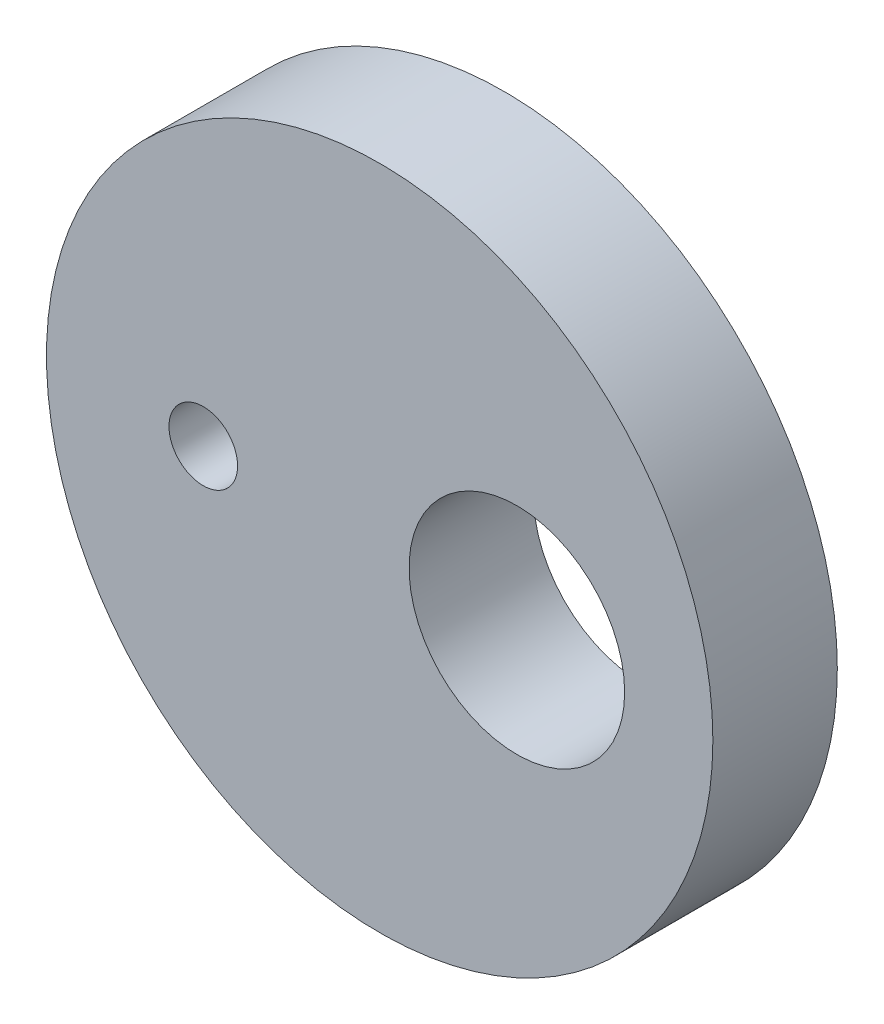
ISO-10303-21;
HEADER;
FILE_DESCRIPTION(('STEP AP214'),'2;1');
FILE_NAME('part.step','',(''),(''),'','','');
FILE_SCHEMA(('AUTOMOTIVE_DESIGN { 1 0 10303 214 1 1 1 1 }'));
ENDSEC;
DATA;
#1=APPLICATION_CONTEXT('core data for automotive mechanical design processes');
#2=APPLICATION_PROTOCOL_DEFINITION('international standard','automotive_design',2000,#1);
#3=PRODUCT_CONTEXT('',#1,'mechanical');
#4=PRODUCT('Part','Part','',(#3));
#5=PRODUCT_RELATED_PRODUCT_CATEGORY('part','',(#4));
#6=PRODUCT_DEFINITION_FORMATION('','',#4);
#7=PRODUCT_DEFINITION_CONTEXT('part definition',#1,'design');
#8=PRODUCT_DEFINITION('design','',#6,#7);
#9=PRODUCT_DEFINITION_SHAPE('','',#8);
#10=(LENGTH_UNIT() NAMED_UNIT(*) SI_UNIT(.MILLI.,.METRE.));
#11=(NAMED_UNIT(*) PLANE_ANGLE_UNIT() SI_UNIT($,.RADIAN.));
#12=(NAMED_UNIT(*) SI_UNIT($,.STERADIAN.) SOLID_ANGLE_UNIT());
#13=UNCERTAINTY_MEASURE_WITH_UNIT(LENGTH_MEASURE(1.E-05),#10,'distance_accuracy_value','');
#14=(GEOMETRIC_REPRESENTATION_CONTEXT(3) GLOBAL_UNCERTAINTY_ASSIGNED_CONTEXT((#13)) GLOBAL_UNIT_ASSIGNED_CONTEXT((#10,
#11,#12)) REPRESENTATION_CONTEXT('',''));
#15=CARTESIAN_POINT('',(0.,0.,0.));
#16=DIRECTION('',(0.,0.,1.));
#17=DIRECTION('',(1.,0.,0.));
#18=AXIS2_PLACEMENT_3D('',#15,#16,#17);
#19=CARTESIAN_POINT('',(-9.,0.,6.35));
#20=DIRECTION('',(0.,0.,-1.));
#21=DIRECTION('',(-1.,0.,0.));
#22=AXIS2_PLACEMENT_3D('',#19,#20,#21);
#23=CYLINDRICAL_SURFACE('',#22,1.75);
#24=CARTESIAN_POINT('',(-9.,0.,6.35));
#25=DIRECTION('',(0.,0.,1.));
#26=DIRECTION('',(1.,0.,0.));
#27=AXIS2_PLACEMENT_3D('',#24,#25,#26);
#28=CIRCLE('',#27,1.75);
#29=CARTESIAN_POINT('',(-7.25,0.,6.35));
#30=VERTEX_POINT('',#29);
#31=EDGE_CURVE('E42',#30,#30,#28,.T.);
#32=ORIENTED_EDGE('',*,*,#31,.T.);
#33=EDGE_LOOP('',(#32));
#34=FACE_BOUND('',#33,.T.);
#35=CARTESIAN_POINT('',(-9.,0.,0.));
#36=DIRECTION('',(0.,0.,1.));
#37=DIRECTION('',(1.,0.,0.));
#38=AXIS2_PLACEMENT_3D('',#35,#36,#37);
#39=CIRCLE('',#38,1.75);
#40=CARTESIAN_POINT('',(-7.25,0.,0.));
#41=VERTEX_POINT('',#40);
#42=EDGE_CURVE('E53',#41,#41,#39,.T.);
#43=ORIENTED_EDGE('',*,*,#42,.F.);
#44=EDGE_LOOP('',(#43));
#45=FACE_BOUND('',#44,.T.);
#46=ADVANCED_FACE('F34',(#34,#45),#23,.F.);
#47=CARTESIAN_POINT('',(7.,-0.12548824001043,6.35));
#48=DIRECTION('',(0.,0.,-1.));
#49=DIRECTION('',(-1.,0.,0.));
#50=AXIS2_PLACEMENT_3D('',#47,#48,#49);
#51=CYLINDRICAL_SURFACE('',#50,5.5);
#52=CARTESIAN_POINT('',(7.,-0.12548824001043,6.35));
#53=DIRECTION('',(0.,0.,1.));
#54=DIRECTION('',(1.,0.,0.));
#55=AXIS2_PLACEMENT_3D('',#52,#53,#54);
#56=CIRCLE('',#55,5.5);
#57=CARTESIAN_POINT('',(12.5,-0.12548824001043,6.35));
#58=VERTEX_POINT('',#57);
#59=EDGE_CURVE('E47',#58,#58,#56,.T.);
#60=ORIENTED_EDGE('',*,*,#59,.T.);
#61=EDGE_LOOP('',(#60));
#62=FACE_BOUND('',#61,.T.);
#63=CARTESIAN_POINT('',(7.,-0.12548824001043,0.));
#64=DIRECTION('',(0.,0.,1.));
#65=DIRECTION('',(1.,0.,0.));
#66=AXIS2_PLACEMENT_3D('',#63,#64,#65);
#67=CIRCLE('',#66,5.5);
#68=CARTESIAN_POINT('',(12.5,-0.12548824001043,0.));
#69=VERTEX_POINT('',#68);
#70=EDGE_CURVE('E51',#69,#69,#67,.T.);
#71=ORIENTED_EDGE('',*,*,#70,.F.);
#72=EDGE_LOOP('',(#71));
#73=FACE_BOUND('',#72,.T.);
#74=ADVANCED_FACE('F36',(#62,#73),#51,.F.);
#75=CARTESIAN_POINT('',(0.,0.,6.35));
#76=DIRECTION('',(0.,0.,-1.));
#77=DIRECTION('',(-1.,0.,0.));
#78=AXIS2_PLACEMENT_3D('',#75,#76,#77);
#79=CYLINDRICAL_SURFACE('',#78,17.);
#80=CARTESIAN_POINT('',(0.,0.,6.35));
#81=DIRECTION('',(0.,0.,1.));
#82=DIRECTION('',(1.,0.,0.));
#83=AXIS2_PLACEMENT_3D('',#80,#81,#82);
#84=CIRCLE('',#83,17.);
#85=CARTESIAN_POINT('',(17.,0.,6.35));
#86=VERTEX_POINT('',#85);
#87=EDGE_CURVE('E10',#86,#86,#84,.T.);
#88=ORIENTED_EDGE('',*,*,#87,.F.);
#89=EDGE_LOOP('',(#88));
#90=FACE_BOUND('',#89,.T.);
#91=CARTESIAN_POINT('',(0.,0.,0.));
#92=DIRECTION('',(0.,0.,1.));
#93=DIRECTION('',(1.,0.,0.));
#94=AXIS2_PLACEMENT_3D('',#91,#92,#93);
#95=CIRCLE('',#94,17.);
#96=CARTESIAN_POINT('',(17.,0.,0.));
#97=VERTEX_POINT('',#96);
#98=EDGE_CURVE('E38',#97,#97,#95,.T.);
#99=ORIENTED_EDGE('',*,*,#98,.T.);
#100=EDGE_LOOP('',(#99));
#101=FACE_BOUND('',#100,.T.);
#102=ADVANCED_FACE('F69',(#90,#101),#79,.T.);
#103=CARTESIAN_POINT('',(0.,0.,6.35));
#104=DIRECTION('',(0.,0.,1.));
#105=DIRECTION('',(1.,0.,0.));
#106=AXIS2_PLACEMENT_3D('',#103,#104,#105);
#107=PLANE('',#106);
#108=ORIENTED_EDGE('',*,*,#59,.F.);
#109=EDGE_LOOP('',(#108));
#110=FACE_BOUND('',#109,.T.);
#111=ORIENTED_EDGE('',*,*,#31,.F.);
#112=EDGE_LOOP('',(#111));
#113=FACE_BOUND('',#112,.T.);
#114=ORIENTED_EDGE('',*,*,#87,.T.);
#115=EDGE_LOOP('',(#114));
#116=FACE_BOUND('',#115,.T.);
#117=ADVANCED_FACE('F65',(#110,#113,#116),#107,.T.);
#118=CARTESIAN_POINT('',(0.,0.,0.));
#119=DIRECTION('',(0.,0.,1.));
#120=DIRECTION('',(1.,0.,0.));
#121=AXIS2_PLACEMENT_3D('',#118,#119,#120);
#122=PLANE('',#121);
#123=ORIENTED_EDGE('',*,*,#70,.T.);
#124=EDGE_LOOP('',(#123));
#125=FACE_BOUND('',#124,.T.);
#126=ORIENTED_EDGE('',*,*,#42,.T.);
#127=EDGE_LOOP('',(#126));
#128=FACE_BOUND('',#127,.T.);
#129=ORIENTED_EDGE('',*,*,#98,.F.);
#130=EDGE_LOOP('',(#129));
#131=FACE_BOUND('',#130,.T.);
#132=ADVANCED_FACE('F68',(#125,#128,#131),#122,.F.);
#133=CLOSED_SHELL('',(#46,#74,#102,#117,#132));
#134=MANIFOLD_SOLID_BREP('B2',#133);
#135=ADVANCED_BREP_SHAPE_REPRESENTATION('',(#18,#134),#14);
#136=SHAPE_DEFINITION_REPRESENTATION(#9,#135);
ENDSEC;
END-ISO-10303-21;
